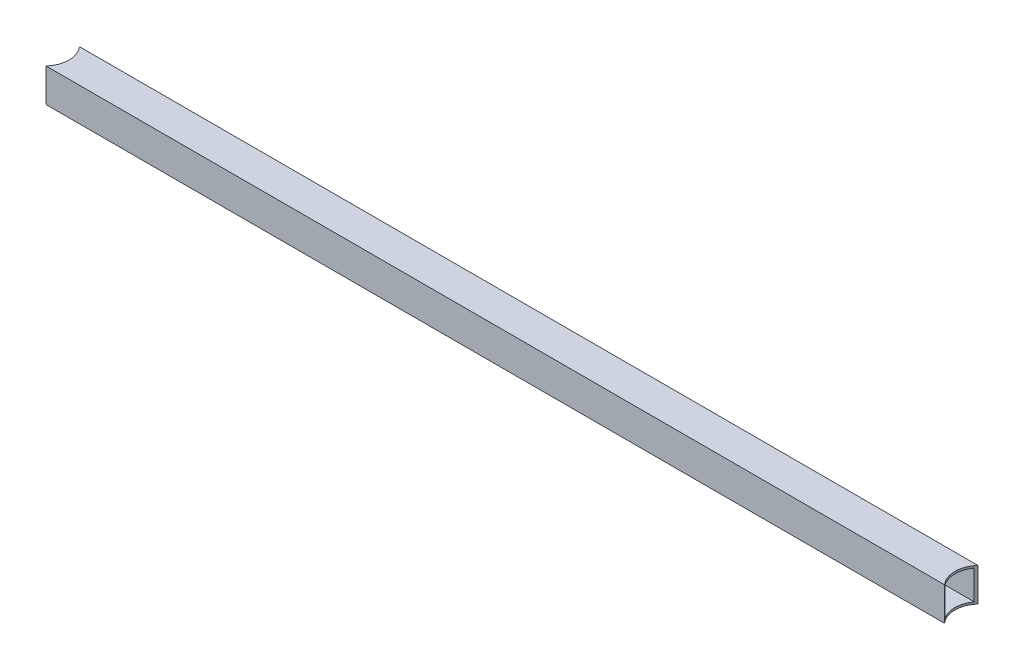
ISO-10303-21;
HEADER;
FILE_DESCRIPTION(('STEP AP214'),'2;1');
FILE_NAME('part.step','',(''),(''),'','','');
FILE_SCHEMA(('AUTOMOTIVE_DESIGN { 1 0 10303 214 1 1 1 1 }'));
ENDSEC;
DATA;
#1=APPLICATION_CONTEXT('core data for automotive mechanical design processes');
#2=APPLICATION_PROTOCOL_DEFINITION('international standard','automotive_design',2000,#1);
#3=PRODUCT_CONTEXT('',#1,'mechanical');
#4=PRODUCT('Part','Part','',(#3));
#5=PRODUCT_RELATED_PRODUCT_CATEGORY('part','',(#4));
#6=PRODUCT_DEFINITION_FORMATION('','',#4);
#7=PRODUCT_DEFINITION_CONTEXT('part definition',#1,'design');
#8=PRODUCT_DEFINITION('design','',#6,#7);
#9=PRODUCT_DEFINITION_SHAPE('','',#8);
#10=(LENGTH_UNIT() NAMED_UNIT(*) SI_UNIT(.MILLI.,.METRE.));
#11=(NAMED_UNIT(*) PLANE_ANGLE_UNIT() SI_UNIT($,.RADIAN.));
#12=(NAMED_UNIT(*) SI_UNIT($,.STERADIAN.) SOLID_ANGLE_UNIT());
#13=UNCERTAINTY_MEASURE_WITH_UNIT(LENGTH_MEASURE(1.E-05),#10,'distance_accuracy_value','');
#14=(GEOMETRIC_REPRESENTATION_CONTEXT(3) GLOBAL_UNCERTAINTY_ASSIGNED_CONTEXT((#13)) GLOBAL_UNIT_ASSIGNED_CONTEXT((#10,
#11,#12)) REPRESENTATION_CONTEXT('',''));
#15=CARTESIAN_POINT('',(0.,0.,0.));
#16=DIRECTION('',(0.,0.,1.));
#17=DIRECTION('',(1.,0.,0.));
#18=AXIS2_PLACEMENT_3D('',#15,#16,#17);
#19=CARTESIAN_POINT('',(711.2,23.8125,-1.5875));
#20=DIRECTION('',(0.,-1.,0.));
#21=DIRECTION('',(0.,0.,-1.));
#22=AXIS2_PLACEMENT_3D('',#19,#20,#21);
#23=PLANE('',#22);
#24=CARTESIAN_POINT('',(0.,23.8125,-12.7));
#25=DIRECTION('',(0.,-1.,0.));
#26=DIRECTION('',(0.,0.,-1.));
#27=AXIS2_PLACEMENT_3D('',#24,#25,#26);
#28=CIRCLE('',#27,19.05);
#29=CARTESIAN_POINT('',(15.4730360223842,23.8125,-23.8125));
#30=VERTEX_POINT('',#29);
#31=CARTESIAN_POINT('',(15.4730360223842,23.8125,-1.5875));
#32=VERTEX_POINT('',#31);
#33=EDGE_CURVE('E11',#30,#32,#28,.T.);
#34=ORIENTED_EDGE('',*,*,#33,.F.);
#35=DIRECTION('',(-1.,0.,0.));
#36=VECTOR('',#35,1.);
#37=CARTESIAN_POINT('',(711.2,23.8125,-23.8125));
#38=LINE('',#37,#36);
#39=CARTESIAN_POINT('',(695.726963977616,23.8125,-23.8125));
#40=VERTEX_POINT('',#39);
#41=EDGE_CURVE('E140',#40,#30,#38,.T.);
#42=ORIENTED_EDGE('',*,*,#41,.F.);
#43=CARTESIAN_POINT('',(711.2,23.8125,-12.7));
#44=DIRECTION('',(0.,-1.,0.));
#45=DIRECTION('',(0.,0.,-1.));
#46=AXIS2_PLACEMENT_3D('',#43,#44,#45);
#47=CIRCLE('',#46,19.05);
#48=CARTESIAN_POINT('',(695.726963977616,23.8125,-1.5875));
#49=VERTEX_POINT('',#48);
#50=EDGE_CURVE('E41',#49,#40,#47,.T.);
#51=ORIENTED_EDGE('',*,*,#50,.F.);
#52=DIRECTION('',(-1.,0.,0.));
#53=VECTOR('',#52,1.);
#54=CARTESIAN_POINT('',(711.2,23.8125,-1.5875));
#55=LINE('',#54,#53);
#56=EDGE_CURVE('E146',#49,#32,#55,.T.);
#57=ORIENTED_EDGE('',*,*,#56,.T.);
#58=EDGE_LOOP('',(#34,#42,#51,#57));
#59=FACE_BOUND('',#58,.T.);
#60=ADVANCED_FACE('F33',(#59),#23,.T.);
#61=CARTESIAN_POINT('',(711.2,1.5875,-23.8125));
#62=DIRECTION('',(0.,0.,1.));
#63=DIRECTION('',(1.,0.,0.));
#64=AXIS2_PLACEMENT_3D('',#61,#62,#63);
#65=PLANE('',#64);
#66=DIRECTION('',(0.,1.,0.));
#67=VECTOR('',#66,1.);
#68=CARTESIAN_POINT('',(15.4730360223842,0.,-23.8125));
#69=LINE('',#68,#67);
#70=CARTESIAN_POINT('',(15.4730360223842,1.5875,-23.8125));
#71=VERTEX_POINT('',#70);
#72=EDGE_CURVE('E166',#71,#30,#69,.T.);
#73=ORIENTED_EDGE('',*,*,#72,.F.);
#74=DIRECTION('',(-1.,0.,0.));
#75=VECTOR('',#74,1.);
#76=CARTESIAN_POINT('',(711.2,1.5875,-23.8125));
#77=LINE('',#76,#75);
#78=CARTESIAN_POINT('',(695.726963977616,1.5875,-23.8125));
#79=VERTEX_POINT('',#78);
#80=EDGE_CURVE('E142',#79,#71,#77,.T.);
#81=ORIENTED_EDGE('',*,*,#80,.F.);
#82=DIRECTION('',(0.,1.,0.));
#83=VECTOR('',#82,1.);
#84=CARTESIAN_POINT('',(695.726963977616,0.,-23.8125));
#85=LINE('',#84,#83);
#86=EDGE_CURVE('E128',#40,#79,#85,.F.);
#87=ORIENTED_EDGE('',*,*,#86,.F.);
#88=ORIENTED_EDGE('',*,*,#41,.T.);
#89=EDGE_LOOP('',(#73,#81,#87,#88));
#90=FACE_BOUND('',#89,.T.);
#91=ADVANCED_FACE('F139',(#90),#65,.T.);
#92=CARTESIAN_POINT('',(711.2,1.5875,-1.5875));
#93=DIRECTION('',(0.,1.,0.));
#94=DIRECTION('',(0.,0.,1.));
#95=AXIS2_PLACEMENT_3D('',#92,#93,#94);
#96=PLANE('',#95);
#97=CARTESIAN_POINT('',(0.,1.5875,-12.7));
#98=DIRECTION('',(0.,1.,0.));
#99=DIRECTION('',(0.,0.,1.));
#100=AXIS2_PLACEMENT_3D('',#97,#98,#99);
#101=CIRCLE('',#100,19.05);
#102=CARTESIAN_POINT('',(15.4730360223842,1.5875,-1.5875));
#103=VERTEX_POINT('',#102);
#104=EDGE_CURVE('E168',#103,#71,#101,.T.);
#105=ORIENTED_EDGE('',*,*,#104,.F.);
#106=DIRECTION('',(-1.,0.,0.));
#107=VECTOR('',#106,1.);
#108=CARTESIAN_POINT('',(711.2,1.5875,-1.5875));
#109=LINE('',#108,#107);
#110=CARTESIAN_POINT('',(695.726963977616,1.5875,-1.5875));
#111=VERTEX_POINT('',#110);
#112=EDGE_CURVE('E148',#111,#103,#109,.T.);
#113=ORIENTED_EDGE('',*,*,#112,.F.);
#114=CARTESIAN_POINT('',(711.2,1.5875,-12.7));
#115=DIRECTION('',(0.,1.,0.));
#116=DIRECTION('',(0.,0.,1.));
#117=AXIS2_PLACEMENT_3D('',#114,#115,#116);
#118=CIRCLE('',#117,19.05);
#119=EDGE_CURVE('E143',#79,#111,#118,.T.);
#120=ORIENTED_EDGE('',*,*,#119,.F.);
#121=ORIENTED_EDGE('',*,*,#80,.T.);
#122=EDGE_LOOP('',(#105,#113,#120,#121));
#123=FACE_BOUND('',#122,.T.);
#124=ADVANCED_FACE('F188',(#123),#96,.T.);
#125=CARTESIAN_POINT('',(711.2,1.5875,-1.5875));
#126=DIRECTION('',(0.,0.,-1.));
#127=DIRECTION('',(-1.,0.,0.));
#128=AXIS2_PLACEMENT_3D('',#125,#126,#127);
#129=PLANE('',#128);
#130=DIRECTION('',(0.,1.,0.));
#131=VECTOR('',#130,1.);
#132=CARTESIAN_POINT('',(15.4730360223842,0.,-1.5875));
#133=LINE('',#132,#131);
#134=EDGE_CURVE('E170',#32,#103,#133,.F.);
#135=ORIENTED_EDGE('',*,*,#134,.F.);
#136=ORIENTED_EDGE('',*,*,#56,.F.);
#137=DIRECTION('',(0.,1.,0.));
#138=VECTOR('',#137,1.);
#139=CARTESIAN_POINT('',(695.726963977616,0.,-1.5875));
#140=LINE('',#139,#138);
#141=EDGE_CURVE('E114',#111,#49,#140,.T.);
#142=ORIENTED_EDGE('',*,*,#141,.F.);
#143=ORIENTED_EDGE('',*,*,#112,.T.);
#144=EDGE_LOOP('',(#135,#136,#142,#143));
#145=FACE_BOUND('',#144,.T.);
#146=ADVANCED_FACE('F181',(#145),#129,.T.);
#147=CARTESIAN_POINT('',(711.2,0.,-12.7));
#148=DIRECTION('',(0.,1.,0.));
#149=DIRECTION('',(0.,0.,1.));
#150=AXIS2_PLACEMENT_3D('',#147,#148,#149);
#151=CYLINDRICAL_SURFACE('',#150,19.05);
#152=ORIENTED_EDGE('',*,*,#141,.T.);
#153=ORIENTED_EDGE('',*,*,#50,.T.);
#154=ORIENTED_EDGE('',*,*,#86,.T.);
#155=ORIENTED_EDGE('',*,*,#119,.T.);
#156=EDGE_LOOP('',(#152,#153,#154,#155));
#157=FACE_BOUND('',#156,.T.);
#158=CARTESIAN_POINT('',(711.2,0.,-12.7));
#159=DIRECTION('',(0.,1.,0.));
#160=DIRECTION('',(0.,0.,1.));
#161=AXIS2_PLACEMENT_3D('',#158,#159,#160);
#162=CIRCLE('',#161,19.05);
#163=CARTESIAN_POINT('',(697.000968342876,0.,-25.4));
#164=VERTEX_POINT('',#163);
#165=CARTESIAN_POINT('',(697.000968342876,0.,0.));
#166=VERTEX_POINT('',#165);
#167=EDGE_CURVE('E95',#164,#166,#162,.T.);
#168=ORIENTED_EDGE('',*,*,#167,.F.);
#169=DIRECTION('',(0.,1.,0.));
#170=VECTOR('',#169,1.);
#171=CARTESIAN_POINT('',(697.000968342876,0.,-25.4));
#172=LINE('',#171,#170);
#173=CARTESIAN_POINT('',(697.000968342876,25.4,-25.4));
#174=VERTEX_POINT('',#173);
#175=EDGE_CURVE('E48',#174,#164,#172,.F.);
#176=ORIENTED_EDGE('',*,*,#175,.F.);
#177=CARTESIAN_POINT('',(711.2,25.4,-12.7));
#178=DIRECTION('',(0.,1.,0.));
#179=DIRECTION('',(0.,0.,1.));
#180=AXIS2_PLACEMENT_3D('',#177,#178,#179);
#181=CIRCLE('',#180,19.05);
#182=CARTESIAN_POINT('',(697.000968342876,25.4,0.));
#183=VERTEX_POINT('',#182);
#184=EDGE_CURVE('E104',#174,#183,#181,.T.);
#185=ORIENTED_EDGE('',*,*,#184,.T.);
#186=DIRECTION('',(0.,1.,0.));
#187=VECTOR('',#186,1.);
#188=CARTESIAN_POINT('',(697.000968342876,0.,0.));
#189=LINE('',#188,#187);
#190=EDGE_CURVE('E98',#166,#183,#189,.T.);
#191=ORIENTED_EDGE('',*,*,#190,.F.);
#192=EDGE_LOOP('',(#168,#176,#185,#191));
#193=FACE_BOUND('',#192,.T.);
#194=ADVANCED_FACE('F96',(#157,#193),#151,.F.);
#195=CARTESIAN_POINT('',(0.,0.,-12.7));
#196=DIRECTION('',(0.,1.,0.));
#197=DIRECTION('',(0.,0.,1.));
#198=AXIS2_PLACEMENT_3D('',#195,#196,#197);
#199=CYLINDRICAL_SURFACE('',#198,19.05);
#200=ORIENTED_EDGE('',*,*,#134,.T.);
#201=ORIENTED_EDGE('',*,*,#104,.T.);
#202=ORIENTED_EDGE('',*,*,#72,.T.);
#203=ORIENTED_EDGE('',*,*,#33,.T.);
#204=EDGE_LOOP('',(#200,#201,#202,#203));
#205=FACE_BOUND('',#204,.T.);
#206=CARTESIAN_POINT('',(0.,25.4,-12.7));
#207=DIRECTION('',(0.,1.,0.));
#208=DIRECTION('',(0.,0.,1.));
#209=AXIS2_PLACEMENT_3D('',#206,#207,#208);
#210=CIRCLE('',#209,19.05);
#211=CARTESIAN_POINT('',(14.1990316571237,25.4,0.));
#212=VERTEX_POINT('',#211);
#213=CARTESIAN_POINT('',(14.1990316571237,25.4,-25.4));
#214=VERTEX_POINT('',#213);
#215=EDGE_CURVE('E103',#212,#214,#210,.T.);
#216=ORIENTED_EDGE('',*,*,#215,.T.);
#217=DIRECTION('',(0.,1.,0.));
#218=VECTOR('',#217,1.);
#219=CARTESIAN_POINT('',(14.1990316571237,0.,-25.4));
#220=LINE('',#219,#218);
#221=CARTESIAN_POINT('',(14.1990316571237,0.,-25.4));
#222=VERTEX_POINT('',#221);
#223=EDGE_CURVE('E172',#222,#214,#220,.T.);
#224=ORIENTED_EDGE('',*,*,#223,.F.);
#225=CARTESIAN_POINT('',(0.,0.,-12.7));
#226=DIRECTION('',(0.,1.,0.));
#227=DIRECTION('',(0.,0.,1.));
#228=AXIS2_PLACEMENT_3D('',#225,#226,#227);
#229=CIRCLE('',#228,19.05);
#230=CARTESIAN_POINT('',(14.1990316571237,0.,0.));
#231=VERTEX_POINT('',#230);
#232=EDGE_CURVE('E118',#231,#222,#229,.T.);
#233=ORIENTED_EDGE('',*,*,#232,.F.);
#234=DIRECTION('',(0.,1.,0.));
#235=VECTOR('',#234,1.);
#236=CARTESIAN_POINT('',(14.1990316571237,0.,0.));
#237=LINE('',#236,#235);
#238=EDGE_CURVE('E56',#212,#231,#237,.F.);
#239=ORIENTED_EDGE('',*,*,#238,.F.);
#240=EDGE_LOOP('',(#216,#224,#233,#239));
#241=FACE_BOUND('',#240,.T.);
#242=ADVANCED_FACE('F173',(#205,#241),#199,.F.);
#243=CARTESIAN_POINT('',(711.2,0.,0.));
#244=DIRECTION('',(0.,0.,-1.));
#245=DIRECTION('',(-1.,0.,0.));
#246=AXIS2_PLACEMENT_3D('',#243,#244,#245);
#247=PLANE('',#246);
#248=DIRECTION('',(-1.,0.,0.));
#249=VECTOR('',#248,1.);
#250=CARTESIAN_POINT('',(711.2,25.4,0.));
#251=LINE('',#250,#249);
#252=EDGE_CURVE('E122',#183,#212,#251,.T.);
#253=ORIENTED_EDGE('',*,*,#252,.T.);
#254=ORIENTED_EDGE('',*,*,#238,.T.);
#255=DIRECTION('',(-1.,0.,0.));
#256=VECTOR('',#255,1.);
#257=CARTESIAN_POINT('',(711.2,0.,0.));
#258=LINE('',#257,#256);
#259=EDGE_CURVE('E119',#166,#231,#258,.T.);
#260=ORIENTED_EDGE('',*,*,#259,.F.);
#261=ORIENTED_EDGE('',*,*,#190,.T.);
#262=EDGE_LOOP('',(#253,#254,#260,#261));
#263=FACE_BOUND('',#262,.T.);
#264=ADVANCED_FACE('F35',(#263),#247,.F.);
#265=CARTESIAN_POINT('',(711.2,0.,0.));
#266=DIRECTION('',(0.,1.,0.));
#267=DIRECTION('',(0.,0.,1.));
#268=AXIS2_PLACEMENT_3D('',#265,#266,#267);
#269=PLANE('',#268);
#270=ORIENTED_EDGE('',*,*,#259,.T.);
#271=ORIENTED_EDGE('',*,*,#232,.T.);
#272=DIRECTION('',(-1.,0.,0.));
#273=VECTOR('',#272,1.);
#274=CARTESIAN_POINT('',(711.2,0.,-25.4));
#275=LINE('',#274,#273);
#276=EDGE_CURVE('E111',#164,#222,#275,.T.);
#277=ORIENTED_EDGE('',*,*,#276,.F.);
#278=ORIENTED_EDGE('',*,*,#167,.T.);
#279=EDGE_LOOP('',(#270,#271,#277,#278));
#280=FACE_BOUND('',#279,.T.);
#281=ADVANCED_FACE('F117',(#280),#269,.F.);
#282=CARTESIAN_POINT('',(711.2,0.,-25.4));
#283=DIRECTION('',(0.,0.,1.));
#284=DIRECTION('',(1.,0.,0.));
#285=AXIS2_PLACEMENT_3D('',#282,#283,#284);
#286=PLANE('',#285);
#287=ORIENTED_EDGE('',*,*,#276,.T.);
#288=ORIENTED_EDGE('',*,*,#223,.T.);
#289=DIRECTION('',(-1.,0.,0.));
#290=VECTOR('',#289,1.);
#291=CARTESIAN_POINT('',(711.2,25.4,-25.4));
#292=LINE('',#291,#290);
#293=EDGE_CURVE('E113',#174,#214,#292,.T.);
#294=ORIENTED_EDGE('',*,*,#293,.F.);
#295=ORIENTED_EDGE('',*,*,#175,.T.);
#296=EDGE_LOOP('',(#287,#288,#294,#295));
#297=FACE_BOUND('',#296,.T.);
#298=ADVANCED_FACE('F109',(#297),#286,.F.);
#299=CARTESIAN_POINT('',(711.2,25.4,0.));
#300=DIRECTION('',(0.,-1.,0.));
#301=DIRECTION('',(0.,0.,-1.));
#302=AXIS2_PLACEMENT_3D('',#299,#300,#301);
#303=PLANE('',#302);
#304=ORIENTED_EDGE('',*,*,#293,.T.);
#305=ORIENTED_EDGE('',*,*,#215,.F.);
#306=ORIENTED_EDGE('',*,*,#252,.F.);
#307=ORIENTED_EDGE('',*,*,#184,.F.);
#308=EDGE_LOOP('',(#304,#305,#306,#307));
#309=FACE_BOUND('',#308,.T.);
#310=ADVANCED_FACE('F158',(#309),#303,.F.);
#311=CLOSED_SHELL('',(#60,#91,#124,#146,#194,#242,#264,#281,#298,#310));
#312=MANIFOLD_SOLID_BREP('B2',#311);
#313=ADVANCED_BREP_SHAPE_REPRESENTATION('',(#18,#312),#14);
#314=SHAPE_DEFINITION_REPRESENTATION(#9,#313);
ENDSEC;
END-ISO-10303-21;
